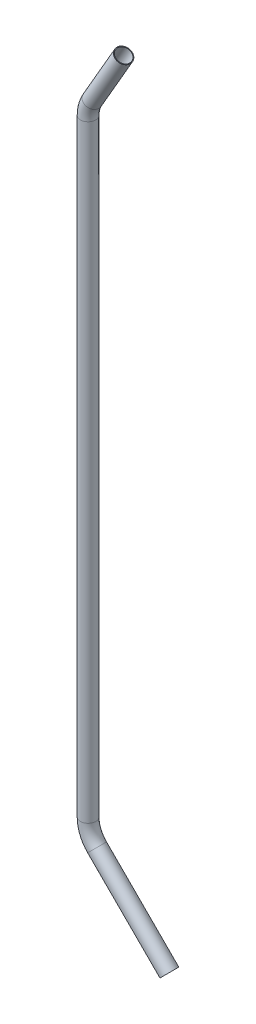
ISO-10303-21;
HEADER;
FILE_DESCRIPTION(('STEP AP214'),'2;1');
FILE_NAME('part.step','',(''),(''),'','','');
FILE_SCHEMA(('AUTOMOTIVE_DESIGN { 1 0 10303 214 1 1 1 1 }'));
ENDSEC;
DATA;
#1=APPLICATION_CONTEXT('core data for automotive mechanical design processes');
#2=APPLICATION_PROTOCOL_DEFINITION('international standard','automotive_design',2000,#1);
#3=PRODUCT_CONTEXT('',#1,'mechanical');
#4=PRODUCT('Part','Part','',(#3));
#5=PRODUCT_RELATED_PRODUCT_CATEGORY('part','',(#4));
#6=PRODUCT_DEFINITION_FORMATION('','',#4);
#7=PRODUCT_DEFINITION_CONTEXT('part definition',#1,'design');
#8=PRODUCT_DEFINITION('design','',#6,#7);
#9=PRODUCT_DEFINITION_SHAPE('','',#8);
#10=(LENGTH_UNIT() NAMED_UNIT(*) SI_UNIT(.MILLI.,.METRE.));
#11=(NAMED_UNIT(*) PLANE_ANGLE_UNIT() SI_UNIT($,.RADIAN.));
#12=(NAMED_UNIT(*) SI_UNIT($,.STERADIAN.) SOLID_ANGLE_UNIT());
#13=UNCERTAINTY_MEASURE_WITH_UNIT(LENGTH_MEASURE(1.E-05),#10,'distance_accuracy_value','');
#14=(GEOMETRIC_REPRESENTATION_CONTEXT(3) GLOBAL_UNCERTAINTY_ASSIGNED_CONTEXT((#13)) GLOBAL_UNIT_ASSIGNED_CONTEXT((#10,
#11,#12)) REPRESENTATION_CONTEXT('',''));
#15=CARTESIAN_POINT('',(0.,0.,0.));
#16=DIRECTION('',(0.,0.,1.));
#17=DIRECTION('',(1.,0.,0.));
#18=AXIS2_PLACEMENT_3D('',#15,#16,#17);
#19=CARTESIAN_POINT('',(-67.7659094877504,769.253486726415,0.));
#20=DIRECTION('',(-0.500000000000001,-0.866025403784438,0.));
#21=DIRECTION('',(0.866025403784438,-0.500000000000001,0.));
#22=AXIS2_PLACEMENT_3D('',#19,#20,#21);
#23=CYLINDRICAL_SURFACE('',#22,9.52500000000001);
#24=CARTESIAN_POINT('',(-106.655567884187,701.89462249479,0.));
#25=DIRECTION('',(0.500000000000001,0.866025403784438,0.));
#26=DIRECTION('',(0.,0.,1.));
#27=AXIS2_PLACEMENT_3D('',#24,#25,#26);
#28=CIRCLE('',#27,9.52500000000001);
#29=CARTESIAN_POINT('',(-114.904459855234,706.65712249479,0.));
#30=VERTEX_POINT('',#29);
#31=EDGE_CURVE('E65',#30,#30,#28,.T.);
#32=ORIENTED_EDGE('',*,*,#31,.T.);
#33=EDGE_LOOP('',(#32));
#34=FACE_BOUND('',#33,.T.);
#35=CARTESIAN_POINT('',(-67.7659094877504,769.253486726415,0.));
#36=DIRECTION('',(0.500000000000001,0.866025403784438,0.));
#37=DIRECTION('',(0.,0.,1.));
#38=AXIS2_PLACEMENT_3D('',#35,#36,#37);
#39=CIRCLE('',#38,9.52500000000001);
#40=CARTESIAN_POINT('',(-67.7659094877504,769.253486726415,9.52500000000001));
#41=VERTEX_POINT('',#40);
#42=EDGE_CURVE('E61',#41,#41,#39,.T.);
#43=ORIENTED_EDGE('',*,*,#42,.F.);
#44=EDGE_LOOP('',(#43));
#45=FACE_BOUND('',#44,.T.);
#46=ADVANCED_FACE('F37',(#34,#45),#23,.T.);
#47=CARTESIAN_POINT('',(-73.66,682.84462249479,0.));
#48=DIRECTION('',(0.,0.,1.));
#49=DIRECTION('',(1.,0.,0.));
#50=AXIS2_PLACEMENT_3D('',#47,#48,#49);
#51=TOROIDAL_SURFACE('',#50,38.1,9.52500000000001);
#52=CARTESIAN_POINT('',(-111.76,682.84462249479,0.));
#53=DIRECTION('',(0.,1.,0.));
#54=DIRECTION('',(0.,0.,1.));
#55=AXIS2_PLACEMENT_3D('',#52,#53,#54);
#56=CIRCLE('',#55,9.52500000000001);
#57=CARTESIAN_POINT('',(-121.285,682.84462249479,0.));
#58=VERTEX_POINT('',#57);
#59=EDGE_CURVE('E69',#58,#58,#56,.T.);
#60=CARTESIAN_POINT('',(-73.66,682.84462249479,0.));
#61=DIRECTION('',(0.,0.,1.));
#62=DIRECTION('',(1.,0.,0.));
#63=AXIS2_PLACEMENT_3D('',#60,#61,#62);
#64=CIRCLE('',#63,47.625);
#65=EDGE_CURVE('',#30,#58,#64,.T.);
#66=ORIENTED_EDGE('',*,*,#31,.F.);
#67=ORIENTED_EDGE('',*,*,#59,.T.);
#68=ORIENTED_EDGE('',*,*,#65,.T.);
#69=ORIENTED_EDGE('',*,*,#65,.F.);
#70=EDGE_LOOP('',(#66,#68,#67,#69));
#71=FACE_BOUND('',#70,.T.);
#72=ADVANCED_FACE('F114',(#71),#51,.T.);
#73=CARTESIAN_POINT('',(-111.76,682.844622494789,0.));
#74=DIRECTION('',(0.,-1.,0.));
#75=DIRECTION('',(0.,0.,-1.));
#76=AXIS2_PLACEMENT_3D('',#73,#74,#75);
#77=CYLINDRICAL_SURFACE('',#76,9.52500000000001);
#78=CARTESIAN_POINT('',(-111.76,-68.9465132735846,0.));
#79=DIRECTION('',(0.,1.,0.));
#80=DIRECTION('',(0.,0.,1.));
#81=AXIS2_PLACEMENT_3D('',#78,#79,#80);
#82=CIRCLE('',#81,9.52500000000001);
#83=CARTESIAN_POINT('',(-121.285,-68.9465132735846,0.));
#84=VERTEX_POINT('',#83);
#85=EDGE_CURVE('E72',#84,#84,#82,.T.);
#86=ORIENTED_EDGE('',*,*,#85,.T.);
#87=EDGE_LOOP('',(#86));
#88=FACE_BOUND('',#87,.T.);
#89=ORIENTED_EDGE('',*,*,#59,.F.);
#90=EDGE_LOOP('',(#89));
#91=FACE_BOUND('',#90,.T.);
#92=ADVANCED_FACE('F94',(#88,#91),#77,.T.);
#93=CARTESIAN_POINT('',(-73.66,-68.9465132735846,0.));
#94=DIRECTION('',(0.,0.,1.));
#95=DIRECTION('',(1.,0.,0.));
#96=AXIS2_PLACEMENT_3D('',#93,#94,#95);
#97=TOROIDAL_SURFACE('',#96,38.1,9.52500000000001);
#98=CARTESIAN_POINT('',(-100.600768363208,-95.887281636792,0.));
#99=DIRECTION('',(-0.707106781186546,0.707106781186549,0.));
#100=DIRECTION('',(0.,0.,1.));
#101=AXIS2_PLACEMENT_3D('',#98,#99,#100);
#102=CIRCLE('',#101,9.52500000000001);
#103=CARTESIAN_POINT('',(-107.335960454009,-102.622473727594,0.));
#104=VERTEX_POINT('',#103);
#105=EDGE_CURVE('E41',#104,#104,#102,.T.);
#106=CARTESIAN_POINT('',(-73.66,-68.9465132735846,0.));
#107=DIRECTION('',(0.,0.,1.));
#108=DIRECTION('',(1.,0.,0.));
#109=AXIS2_PLACEMENT_3D('',#106,#107,#108);
#110=CIRCLE('',#109,47.625);
#111=EDGE_CURVE('',#84,#104,#110,.T.);
#112=ORIENTED_EDGE('',*,*,#85,.F.);
#113=ORIENTED_EDGE('',*,*,#105,.T.);
#114=ORIENTED_EDGE('',*,*,#111,.T.);
#115=ORIENTED_EDGE('',*,*,#111,.F.);
#116=EDGE_LOOP('',(#112,#114,#113,#115));
#117=FACE_BOUND('',#116,.T.);
#118=ADVANCED_FACE('F81',(#117),#97,.T.);
#119=CARTESIAN_POINT('',(-100.600768363208,-95.887281636792,0.));
#120=DIRECTION('',(0.707106781186546,-0.707106781186549,0.));
#121=DIRECTION('',(0.707106781186549,0.707106781186546,0.));
#122=AXIS2_PLACEMENT_3D('',#119,#120,#121);
#123=CYLINDRICAL_SURFACE('',#122,9.52500000000001);
#124=CARTESIAN_POINT('',(-11.1592316367925,-185.328818363207,0.));
#125=DIRECTION('',(-0.707106781186546,0.707106781186549,0.));
#126=DIRECTION('',(0.,0.,1.));
#127=AXIS2_PLACEMENT_3D('',#124,#125,#126);
#128=CIRCLE('',#127,9.52500000000001);
#129=CARTESIAN_POINT('',(-11.1592316367925,-185.328818363207,9.52500000000001));
#130=VERTEX_POINT('',#129);
#131=EDGE_CURVE('E56',#130,#130,#128,.T.);
#132=ORIENTED_EDGE('',*,*,#131,.T.);
#133=EDGE_LOOP('',(#132));
#134=FACE_BOUND('',#133,.T.);
#135=ORIENTED_EDGE('',*,*,#105,.F.);
#136=EDGE_LOOP('',(#135));
#137=FACE_BOUND('',#136,.T.);
#138=ADVANCED_FACE('F39',(#134,#137),#123,.T.);
#139=CARTESIAN_POINT('',(-67.7659094877504,769.253486726415,0.));
#140=DIRECTION('',(0.500000000000001,0.866025403784438,0.));
#141=DIRECTION('',(0.,0.,1.));
#142=AXIS2_PLACEMENT_3D('',#139,#140,#141);
#143=PLANE('',#142);
#144=CARTESIAN_POINT('',(-67.7659094877504,769.253486726415,0.));
#145=DIRECTION('',(0.500000000000001,0.866025403784438,0.));
#146=DIRECTION('',(0.,0.,1.));
#147=AXIS2_PLACEMENT_3D('',#144,#145,#146);
#148=CIRCLE('',#147,8.7122);
#149=CARTESIAN_POINT('',(-67.7659094877504,769.253486726415,8.7122));
#150=VERTEX_POINT('',#149);
#151=EDGE_CURVE('E60',#150,#150,#148,.F.);
#152=ORIENTED_EDGE('',*,*,#151,.T.);
#153=EDGE_LOOP('',(#152));
#154=FACE_BOUND('',#153,.T.);
#155=ORIENTED_EDGE('',*,*,#42,.T.);
#156=EDGE_LOOP('',(#155));
#157=FACE_BOUND('',#156,.T.);
#158=ADVANCED_FACE('F85',(#154,#157),#143,.T.);
#159=CARTESIAN_POINT('',(-11.1592316367925,-185.328818363207,0.));
#160=DIRECTION('',(-0.707106781186546,0.707106781186549,0.));
#161=DIRECTION('',(0.,0.,1.));
#162=AXIS2_PLACEMENT_3D('',#159,#160,#161);
#163=PLANE('',#162);
#164=CARTESIAN_POINT('',(-11.1592316367925,-185.328818363207,0.));
#165=DIRECTION('',(-0.707106781186546,0.707106781186549,0.));
#166=DIRECTION('',(0.,0.,1.));
#167=AXIS2_PLACEMENT_3D('',#164,#165,#166);
#168=CIRCLE('',#167,8.7122);
#169=CARTESIAN_POINT('',(-11.1592316367925,-185.328818363207,8.7122));
#170=VERTEX_POINT('',#169);
#171=EDGE_CURVE('E10',#170,#170,#168,.F.);
#172=ORIENTED_EDGE('',*,*,#171,.F.);
#173=EDGE_LOOP('',(#172));
#174=FACE_BOUND('',#173,.T.);
#175=ORIENTED_EDGE('',*,*,#131,.F.);
#176=EDGE_LOOP('',(#175));
#177=FACE_BOUND('',#176,.T.);
#178=ADVANCED_FACE('F91',(#174,#177),#163,.F.);
#179=CARTESIAN_POINT('',(-67.7659094877504,769.253486726415,0.));
#180=DIRECTION('',(-0.500000000000001,-0.866025403784438,0.));
#181=DIRECTION('',(0.866025403784438,-0.500000000000001,0.));
#182=AXIS2_PLACEMENT_3D('',#179,#180,#181);
#183=CYLINDRICAL_SURFACE('',#182,8.7122);
#184=CARTESIAN_POINT('',(-106.655567884187,701.89462249479,0.));
#185=DIRECTION('',(0.500000000000001,0.866025403784438,0.));
#186=DIRECTION('',(0.,0.,1.));
#187=AXIS2_PLACEMENT_3D('',#184,#185,#186);
#188=CIRCLE('',#187,8.7122);
#189=CARTESIAN_POINT('',(-114.200554407038,706.25072249479,0.));
#190=VERTEX_POINT('',#189);
#191=EDGE_CURVE('E199',#190,#190,#188,.F.);
#192=ORIENTED_EDGE('',*,*,#191,.T.);
#193=EDGE_LOOP('',(#192));
#194=FACE_BOUND('',#193,.T.);
#195=ORIENTED_EDGE('',*,*,#151,.F.);
#196=EDGE_LOOP('',(#195));
#197=FACE_BOUND('',#196,.T.);
#198=ADVANCED_FACE('F109',(#194,#197),#183,.F.);
#199=CARTESIAN_POINT('',(-73.66,682.84462249479,0.));
#200=DIRECTION('',(0.,0.,1.));
#201=DIRECTION('',(1.,0.,0.));
#202=AXIS2_PLACEMENT_3D('',#199,#200,#201);
#203=TOROIDAL_SURFACE('',#202,38.1,8.7122);
#204=CARTESIAN_POINT('',(-111.76,682.84462249479,0.));
#205=DIRECTION('',(0.,1.,0.));
#206=DIRECTION('',(0.,0.,1.));
#207=AXIS2_PLACEMENT_3D('',#204,#205,#206);
#208=CIRCLE('',#207,8.7122);
#209=CARTESIAN_POINT('',(-120.4722,682.84462249479,0.));
#210=VERTEX_POINT('',#209);
#211=EDGE_CURVE('E197',#210,#210,#208,.F.);
#212=CARTESIAN_POINT('',(-73.66,682.84462249479,0.));
#213=DIRECTION('',(0.,0.,1.));
#214=DIRECTION('',(1.,0.,0.));
#215=AXIS2_PLACEMENT_3D('',#212,#213,#214);
#216=CIRCLE('',#215,46.8122);
#217=EDGE_CURVE('',#190,#210,#216,.T.);
#218=ORIENTED_EDGE('',*,*,#191,.F.);
#219=ORIENTED_EDGE('',*,*,#211,.T.);
#220=ORIENTED_EDGE('',*,*,#217,.T.);
#221=ORIENTED_EDGE('',*,*,#217,.F.);
#222=EDGE_LOOP('',(#218,#220,#219,#221));
#223=FACE_BOUND('',#222,.T.);
#224=ADVANCED_FACE('F160',(#223),#203,.F.);
#225=CARTESIAN_POINT('',(-111.76,682.844622494789,0.));
#226=DIRECTION('',(0.,-1.,0.));
#227=DIRECTION('',(0.,0.,-1.));
#228=AXIS2_PLACEMENT_3D('',#225,#226,#227);
#229=CYLINDRICAL_SURFACE('',#228,8.7122);
#230=CARTESIAN_POINT('',(-111.76,-68.9465132735846,0.));
#231=DIRECTION('',(0.,1.,0.));
#232=DIRECTION('',(0.,0.,1.));
#233=AXIS2_PLACEMENT_3D('',#230,#231,#232);
#234=CIRCLE('',#233,8.7122);
#235=CARTESIAN_POINT('',(-120.4722,-68.9465132735846,0.));
#236=VERTEX_POINT('',#235);
#237=EDGE_CURVE('E52',#236,#236,#234,.F.);
#238=ORIENTED_EDGE('',*,*,#237,.T.);
#239=EDGE_LOOP('',(#238));
#240=FACE_BOUND('',#239,.T.);
#241=ORIENTED_EDGE('',*,*,#211,.F.);
#242=EDGE_LOOP('',(#241));
#243=FACE_BOUND('',#242,.T.);
#244=ADVANCED_FACE('F102',(#240,#243),#229,.F.);
#245=CARTESIAN_POINT('',(-73.66,-68.9465132735846,0.));
#246=DIRECTION('',(0.,0.,1.));
#247=DIRECTION('',(1.,0.,0.));
#248=AXIS2_PLACEMENT_3D('',#245,#246,#247);
#249=TOROIDAL_SURFACE('',#248,38.1,8.7122);
#250=CARTESIAN_POINT('',(-100.600768363208,-95.887281636792,0.));
#251=DIRECTION('',(-0.707106781186546,0.707106781186549,0.));
#252=DIRECTION('',(0.,0.,1.));
#253=AXIS2_PLACEMENT_3D('',#250,#251,#252);
#254=CIRCLE('',#253,8.7122);
#255=CARTESIAN_POINT('',(-106.761224062261,-102.047737335845,0.));
#256=VERTEX_POINT('',#255);
#257=EDGE_CURVE('E46',#256,#256,#254,.F.);
#258=CARTESIAN_POINT('',(-73.66,-68.9465132735846,0.));
#259=DIRECTION('',(0.,0.,1.));
#260=DIRECTION('',(1.,0.,0.));
#261=AXIS2_PLACEMENT_3D('',#258,#259,#260);
#262=CIRCLE('',#261,46.8122);
#263=EDGE_CURVE('',#236,#256,#262,.T.);
#264=ORIENTED_EDGE('',*,*,#237,.F.);
#265=ORIENTED_EDGE('',*,*,#257,.T.);
#266=ORIENTED_EDGE('',*,*,#263,.T.);
#267=ORIENTED_EDGE('',*,*,#263,.F.);
#268=EDGE_LOOP('',(#264,#266,#265,#267));
#269=FACE_BOUND('',#268,.T.);
#270=ADVANCED_FACE('F97',(#269),#249,.F.);
#271=CARTESIAN_POINT('',(-100.600768363208,-95.887281636792,0.));
#272=DIRECTION('',(0.707106781186546,-0.707106781186549,0.));
#273=DIRECTION('',(0.707106781186549,0.707106781186546,0.));
#274=AXIS2_PLACEMENT_3D('',#271,#272,#273);
#275=CYLINDRICAL_SURFACE('',#274,8.7122);
#276=ORIENTED_EDGE('',*,*,#171,.T.);
#277=EDGE_LOOP('',(#276));
#278=FACE_BOUND('',#277,.T.);
#279=ORIENTED_EDGE('',*,*,#257,.F.);
#280=EDGE_LOOP('',(#279));
#281=FACE_BOUND('',#280,.T.);
#282=ADVANCED_FACE('F95',(#278,#281),#275,.F.);
#283=CLOSED_SHELL('',(#46,#72,#92,#118,#138,#158,#178,#198,#224,#244,#270,#282));
#284=MANIFOLD_SOLID_BREP('B2',#283);
#285=ADVANCED_BREP_SHAPE_REPRESENTATION('',(#18,#284),#14);
#286=SHAPE_DEFINITION_REPRESENTATION(#9,#285);
ENDSEC;
END-ISO-10303-21;
